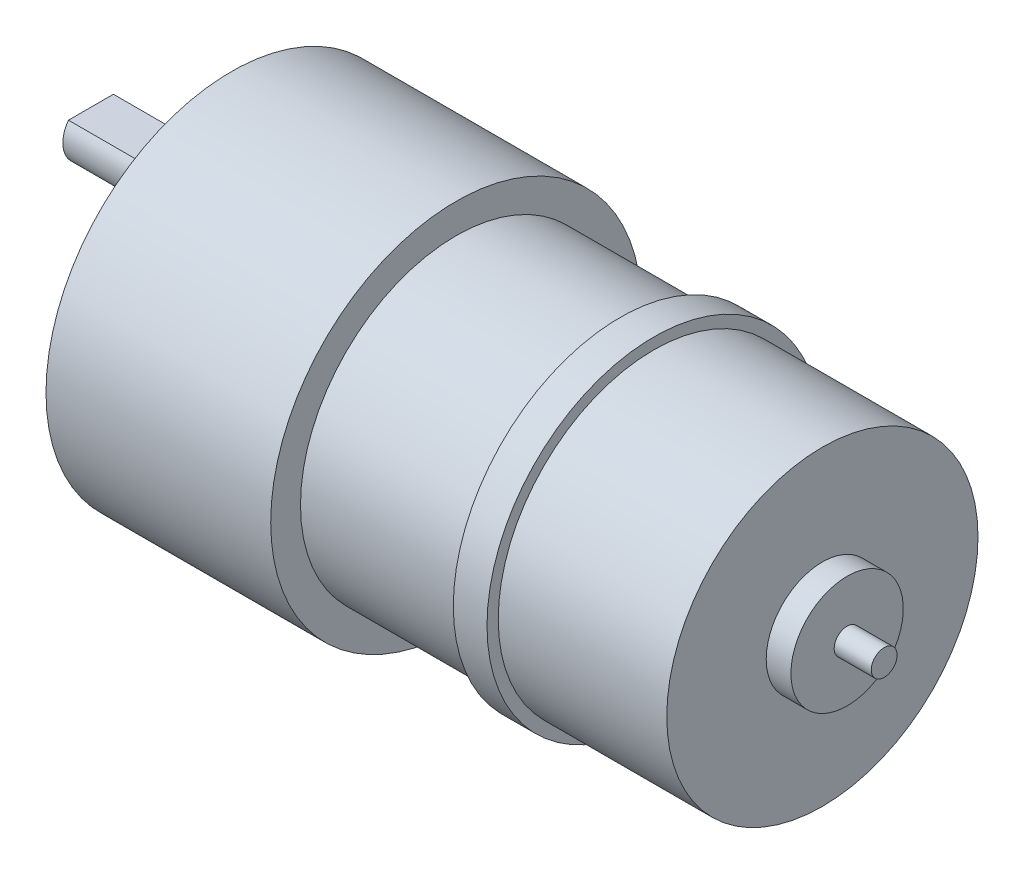
ISO-10303-21;
HEADER;
FILE_DESCRIPTION(('STEP AP214'),'2;1');
FILE_NAME('part.step','',(''),(''),'','','');
FILE_SCHEMA(('AUTOMOTIVE_DESIGN { 1 0 10303 214 1 1 1 1 }'));
ENDSEC;
DATA;
#1=APPLICATION_CONTEXT('core data for automotive mechanical design processes');
#2=APPLICATION_PROTOCOL_DEFINITION('international standard','automotive_design',2000,#1);
#3=PRODUCT_CONTEXT('',#1,'mechanical');
#4=PRODUCT('Part','Part','',(#3));
#5=PRODUCT_RELATED_PRODUCT_CATEGORY('part','',(#4));
#6=PRODUCT_DEFINITION_FORMATION('','',#4);
#7=PRODUCT_DEFINITION_CONTEXT('part definition',#1,'design');
#8=PRODUCT_DEFINITION('design','',#6,#7);
#9=PRODUCT_DEFINITION_SHAPE('','',#8);
#10=(LENGTH_UNIT() NAMED_UNIT(*) SI_UNIT(.MILLI.,.METRE.));
#11=(NAMED_UNIT(*) PLANE_ANGLE_UNIT() SI_UNIT($,.RADIAN.));
#12=(NAMED_UNIT(*) SI_UNIT($,.STERADIAN.) SOLID_ANGLE_UNIT());
#13=UNCERTAINTY_MEASURE_WITH_UNIT(LENGTH_MEASURE(1.E-05),#10,'distance_accuracy_value','');
#14=(GEOMETRIC_REPRESENTATION_CONTEXT(3) GLOBAL_UNCERTAINTY_ASSIGNED_CONTEXT((#13)) GLOBAL_UNIT_ASSIGNED_CONTEXT((#10,
#11,#12)) REPRESENTATION_CONTEXT('',''));
#15=CARTESIAN_POINT('',(0.,0.,0.));
#16=DIRECTION('',(0.,0.,1.));
#17=DIRECTION('',(1.,0.,0.));
#18=AXIS2_PLACEMENT_3D('',#15,#16,#17);
#19=CARTESIAN_POINT('',(58.1,0.,0.));
#20=DIRECTION('',(-1.,0.,0.));
#21=DIRECTION('',(0.,0.,1.));
#22=AXIS2_PLACEMENT_3D('',#19,#20,#21);
#23=PLANE('',#22);
#24=CARTESIAN_POINT('',(58.1,0.,0.));
#25=DIRECTION('',(-1.,0.,0.));
#26=DIRECTION('',(0.,0.,1.));
#27=AXIS2_PLACEMENT_3D('',#24,#25,#26);
#28=CIRCLE('',#27,1.15);
#29=CARTESIAN_POINT('',(58.1,0.,1.15));
#30=VERTEX_POINT('',#29);
#31=EDGE_CURVE('E11',#30,#30,#28,.T.);
#32=ORIENTED_EDGE('',*,*,#31,.F.);
#33=EDGE_LOOP('',(#32));
#34=FACE_BOUND('',#33,.T.);
#35=ADVANCED_FACE('F36',(#34),#23,.F.);
#36=CARTESIAN_POINT('',(0.,0.,0.));
#37=DIRECTION('',(-1.,0.,0.));
#38=DIRECTION('',(0.,0.,1.));
#39=AXIS2_PLACEMENT_3D('',#36,#37,#38);
#40=CYLINDRICAL_SURFACE('',#39,1.15);
#41=ORIENTED_EDGE('',*,*,#31,.T.);
#42=EDGE_LOOP('',(#41));
#43=FACE_BOUND('',#42,.T.);
#44=CARTESIAN_POINT('',(54.8,0.,0.));
#45=DIRECTION('',(-1.,0.,0.));
#46=DIRECTION('',(0.,0.,1.));
#47=AXIS2_PLACEMENT_3D('',#44,#45,#46);
#48=CIRCLE('',#47,1.15);
#49=CARTESIAN_POINT('',(54.8,0.,1.15));
#50=VERTEX_POINT('',#49);
#51=EDGE_CURVE('E43',#50,#50,#48,.T.);
#52=ORIENTED_EDGE('',*,*,#51,.F.);
#53=EDGE_LOOP('',(#52));
#54=FACE_BOUND('',#53,.T.);
#55=ADVANCED_FACE('F121',(#43,#54),#40,.T.);
#56=CARTESIAN_POINT('',(54.8,0.,0.));
#57=DIRECTION('',(-1.,0.,0.));
#58=DIRECTION('',(0.,0.,1.));
#59=AXIS2_PLACEMENT_3D('',#56,#57,#58);
#60=PLANE('',#59);
#61=CARTESIAN_POINT('',(54.8,0.,0.));
#62=DIRECTION('',(-1.,0.,0.));
#63=DIRECTION('',(0.,0.,1.));
#64=AXIS2_PLACEMENT_3D('',#61,#62,#63);
#65=CIRCLE('',#64,5.);
#66=CARTESIAN_POINT('',(54.8,0.,5.));
#67=VERTEX_POINT('',#66);
#68=EDGE_CURVE('E114',#67,#67,#65,.T.);
#69=ORIENTED_EDGE('',*,*,#68,.F.);
#70=EDGE_LOOP('',(#69));
#71=FACE_BOUND('',#70,.T.);
#72=ORIENTED_EDGE('',*,*,#51,.T.);
#73=EDGE_LOOP('',(#72));
#74=FACE_BOUND('',#73,.T.);
#75=ADVANCED_FACE('F119',(#71,#74),#60,.F.);
#76=CARTESIAN_POINT('',(0.,0.,0.));
#77=DIRECTION('',(-1.,0.,0.));
#78=DIRECTION('',(0.,0.,1.));
#79=AXIS2_PLACEMENT_3D('',#76,#77,#78);
#80=CYLINDRICAL_SURFACE('',#79,5.);
#81=ORIENTED_EDGE('',*,*,#68,.T.);
#82=EDGE_LOOP('',(#81));
#83=FACE_BOUND('',#82,.T.);
#84=CARTESIAN_POINT('',(52.6,0.,0.));
#85=DIRECTION('',(-1.,0.,0.));
#86=DIRECTION('',(0.,0.,1.));
#87=AXIS2_PLACEMENT_3D('',#84,#85,#86);
#88=CIRCLE('',#87,5.);
#89=CARTESIAN_POINT('',(52.6,0.,5.));
#90=VERTEX_POINT('',#89);
#91=EDGE_CURVE('E111',#90,#90,#88,.T.);
#92=ORIENTED_EDGE('',*,*,#91,.F.);
#93=EDGE_LOOP('',(#92));
#94=FACE_BOUND('',#93,.T.);
#95=ADVANCED_FACE('F128',(#83,#94),#80,.T.);
#96=CARTESIAN_POINT('',(52.6,0.,0.));
#97=DIRECTION('',(-1.,0.,0.));
#98=DIRECTION('',(0.,0.,1.));
#99=AXIS2_PLACEMENT_3D('',#96,#97,#98);
#100=PLANE('',#99);
#101=CARTESIAN_POINT('',(52.6,0.,0.));
#102=DIRECTION('',(-1.,0.,0.));
#103=DIRECTION('',(0.,0.,1.));
#104=AXIS2_PLACEMENT_3D('',#101,#102,#103);
#105=CIRCLE('',#104,13.85);
#106=CARTESIAN_POINT('',(52.6,0.,13.85));
#107=VERTEX_POINT('',#106);
#108=EDGE_CURVE('E108',#107,#107,#105,.T.);
#109=ORIENTED_EDGE('',*,*,#108,.F.);
#110=EDGE_LOOP('',(#109));
#111=FACE_BOUND('',#110,.T.);
#112=ORIENTED_EDGE('',*,*,#91,.T.);
#113=EDGE_LOOP('',(#112));
#114=FACE_BOUND('',#113,.T.);
#115=ADVANCED_FACE('F135',(#111,#114),#100,.F.);
#116=CARTESIAN_POINT('',(0.,0.,0.));
#117=DIRECTION('',(-1.,0.,0.));
#118=DIRECTION('',(0.,0.,1.));
#119=AXIS2_PLACEMENT_3D('',#116,#117,#118);
#120=CYLINDRICAL_SURFACE('',#119,13.85);
#121=ORIENTED_EDGE('',*,*,#108,.T.);
#122=EDGE_LOOP('',(#121));
#123=FACE_BOUND('',#122,.T.);
#124=CARTESIAN_POINT('',(37.6,0.,0.));
#125=DIRECTION('',(-1.,0.,0.));
#126=DIRECTION('',(0.,0.,1.));
#127=AXIS2_PLACEMENT_3D('',#124,#125,#126);
#128=CIRCLE('',#127,13.85);
#129=CARTESIAN_POINT('',(37.6,0.,13.85));
#130=VERTEX_POINT('',#129);
#131=EDGE_CURVE('E105',#130,#130,#128,.T.);
#132=ORIENTED_EDGE('',*,*,#131,.F.);
#133=EDGE_LOOP('',(#132));
#134=FACE_BOUND('',#133,.T.);
#135=ADVANCED_FACE('F139',(#123,#134),#120,.T.);
#136=CARTESIAN_POINT('',(37.6,0.,0.));
#137=DIRECTION('',(-1.,0.,0.));
#138=DIRECTION('',(0.,0.,1.));
#139=AXIS2_PLACEMENT_3D('',#136,#137,#138);
#140=PLANE('',#139);
#141=CARTESIAN_POINT('',(37.6,0.,0.));
#142=DIRECTION('',(-1.,0.,0.));
#143=DIRECTION('',(0.,0.,1.));
#144=AXIS2_PLACEMENT_3D('',#141,#142,#143);
#145=CIRCLE('',#144,14.85);
#146=CARTESIAN_POINT('',(37.6,0.,14.85));
#147=VERTEX_POINT('',#146);
#148=EDGE_CURVE('E102',#147,#147,#145,.T.);
#149=ORIENTED_EDGE('',*,*,#148,.F.);
#150=EDGE_LOOP('',(#149));
#151=FACE_BOUND('',#150,.T.);
#152=ORIENTED_EDGE('',*,*,#131,.T.);
#153=EDGE_LOOP('',(#152));
#154=FACE_BOUND('',#153,.T.);
#155=ADVANCED_FACE('F143',(#151,#154),#140,.F.);
#156=CARTESIAN_POINT('',(0.,0.,0.));
#157=DIRECTION('',(-1.,0.,0.));
#158=DIRECTION('',(0.,0.,1.));
#159=AXIS2_PLACEMENT_3D('',#156,#157,#158);
#160=CYLINDRICAL_SURFACE('',#159,14.85);
#161=ORIENTED_EDGE('',*,*,#148,.T.);
#162=EDGE_LOOP('',(#161));
#163=FACE_BOUND('',#162,.T.);
#164=CARTESIAN_POINT('',(34.6,0.,0.));
#165=DIRECTION('',(-1.,0.,0.));
#166=DIRECTION('',(0.,0.,1.));
#167=AXIS2_PLACEMENT_3D('',#164,#165,#166);
#168=CIRCLE('',#167,14.85);
#169=CARTESIAN_POINT('',(34.6,0.,14.85));
#170=VERTEX_POINT('',#169);
#171=EDGE_CURVE('E99',#170,#170,#168,.T.);
#172=ORIENTED_EDGE('',*,*,#171,.F.);
#173=EDGE_LOOP('',(#172));
#174=FACE_BOUND('',#173,.T.);
#175=ADVANCED_FACE('F147',(#163,#174),#160,.T.);
#176=CARTESIAN_POINT('',(34.6,0.,0.));
#177=DIRECTION('',(-1.,0.,0.));
#178=DIRECTION('',(0.,0.,1.));
#179=AXIS2_PLACEMENT_3D('',#176,#177,#178);
#180=PLANE('',#179);
#181=ORIENTED_EDGE('',*,*,#171,.T.);
#182=EDGE_LOOP('',(#181));
#183=FACE_BOUND('',#182,.T.);
#184=CARTESIAN_POINT('',(34.6,0.,0.));
#185=DIRECTION('',(-1.,0.,0.));
#186=DIRECTION('',(0.,0.,1.));
#187=AXIS2_PLACEMENT_3D('',#184,#185,#186);
#188=CIRCLE('',#187,13.85);
#189=CARTESIAN_POINT('',(34.6,0.,13.85));
#190=VERTEX_POINT('',#189);
#191=EDGE_CURVE('E96',#190,#190,#188,.T.);
#192=ORIENTED_EDGE('',*,*,#191,.F.);
#193=EDGE_LOOP('',(#192));
#194=FACE_BOUND('',#193,.T.);
#195=ADVANCED_FACE('F151',(#183,#194),#180,.T.);
#196=CARTESIAN_POINT('',(0.,0.,0.));
#197=DIRECTION('',(-1.,0.,0.));
#198=DIRECTION('',(0.,0.,1.));
#199=AXIS2_PLACEMENT_3D('',#196,#197,#198);
#200=CYLINDRICAL_SURFACE('',#199,13.85);
#201=ORIENTED_EDGE('',*,*,#191,.T.);
#202=EDGE_LOOP('',(#201));
#203=FACE_BOUND('',#202,.T.);
#204=CARTESIAN_POINT('',(20.,0.,0.));
#205=DIRECTION('',(-1.,0.,0.));
#206=DIRECTION('',(0.,0.,1.));
#207=AXIS2_PLACEMENT_3D('',#204,#205,#206);
#208=CIRCLE('',#207,13.85);
#209=CARTESIAN_POINT('',(20.,0.,13.85));
#210=VERTEX_POINT('',#209);
#211=EDGE_CURVE('E93',#210,#210,#208,.T.);
#212=ORIENTED_EDGE('',*,*,#211,.F.);
#213=EDGE_LOOP('',(#212));
#214=FACE_BOUND('',#213,.T.);
#215=ADVANCED_FACE('F155',(#203,#214),#200,.T.);
#216=CARTESIAN_POINT('',(20.,0.,0.));
#217=DIRECTION('',(-1.,0.,0.));
#218=DIRECTION('',(0.,0.,1.));
#219=AXIS2_PLACEMENT_3D('',#216,#217,#218);
#220=PLANE('',#219);
#221=CARTESIAN_POINT('',(20.,0.,0.));
#222=DIRECTION('',(-1.,0.,0.));
#223=DIRECTION('',(0.,0.,1.));
#224=AXIS2_PLACEMENT_3D('',#221,#222,#223);
#225=CIRCLE('',#224,16.5);
#226=CARTESIAN_POINT('',(20.,0.,16.5));
#227=VERTEX_POINT('',#226);
#228=EDGE_CURVE('E90',#227,#227,#225,.T.);
#229=ORIENTED_EDGE('',*,*,#228,.F.);
#230=EDGE_LOOP('',(#229));
#231=FACE_BOUND('',#230,.T.);
#232=ORIENTED_EDGE('',*,*,#211,.T.);
#233=EDGE_LOOP('',(#232));
#234=FACE_BOUND('',#233,.T.);
#235=ADVANCED_FACE('F159',(#231,#234),#220,.F.);
#236=CARTESIAN_POINT('',(0.,0.,0.));
#237=DIRECTION('',(-1.,0.,0.));
#238=DIRECTION('',(0.,0.,1.));
#239=AXIS2_PLACEMENT_3D('',#236,#237,#238);
#240=CYLINDRICAL_SURFACE('',#239,16.5);
#241=ORIENTED_EDGE('',*,*,#228,.T.);
#242=EDGE_LOOP('',(#241));
#243=FACE_BOUND('',#242,.T.);
#244=CARTESIAN_POINT('',(0.,0.,0.));
#245=DIRECTION('',(-1.,0.,0.));
#246=DIRECTION('',(0.,0.,1.));
#247=AXIS2_PLACEMENT_3D('',#244,#245,#246);
#248=CIRCLE('',#247,16.5);
#249=CARTESIAN_POINT('',(0.,0.,16.5));
#250=VERTEX_POINT('',#249);
#251=EDGE_CURVE('E87',#250,#250,#248,.T.);
#252=ORIENTED_EDGE('',*,*,#251,.F.);
#253=EDGE_LOOP('',(#252));
#254=FACE_BOUND('',#253,.T.);
#255=ADVANCED_FACE('F163',(#243,#254),#240,.T.);
#256=CARTESIAN_POINT('',(0.,0.,0.));
#257=DIRECTION('',(-1.,0.,0.));
#258=DIRECTION('',(0.,0.,1.));
#259=AXIS2_PLACEMENT_3D('',#256,#257,#258);
#260=PLANE('',#259);
#261=CARTESIAN_POINT('',(0.,6.,0.));
#262=DIRECTION('',(-1.,0.,0.));
#263=DIRECTION('',(0.,0.,1.));
#264=AXIS2_PLACEMENT_3D('',#261,#262,#263);
#265=CIRCLE('',#264,5.);
#266=CARTESIAN_POINT('',(0.,6.,5.));
#267=VERTEX_POINT('',#266);
#268=EDGE_CURVE('E84',#267,#267,#265,.T.);
#269=ORIENTED_EDGE('',*,*,#268,.F.);
#270=EDGE_LOOP('',(#269));
#271=FACE_BOUND('',#270,.T.);
#272=ORIENTED_EDGE('',*,*,#251,.T.);
#273=EDGE_LOOP('',(#272));
#274=FACE_BOUND('',#273,.T.);
#275=ADVANCED_FACE('F167',(#271,#274),#260,.T.);
#276=CARTESIAN_POINT('',(-12.5,6.,0.));
#277=DIRECTION('',(-1.,0.,0.));
#278=DIRECTION('',(0.,0.,1.));
#279=AXIS2_PLACEMENT_3D('',#276,#277,#278);
#280=CYLINDRICAL_SURFACE('',#279,5.);
#281=CARTESIAN_POINT('',(-2.,6.,0.));
#282=DIRECTION('',(-1.,0.,0.));
#283=DIRECTION('',(0.,0.,1.));
#284=AXIS2_PLACEMENT_3D('',#281,#282,#283);
#285=CIRCLE('',#284,5.);
#286=CARTESIAN_POINT('',(-2.,6.,5.));
#287=VERTEX_POINT('',#286);
#288=EDGE_CURVE('E78',#287,#287,#285,.T.);
#289=ORIENTED_EDGE('',*,*,#288,.F.);
#290=EDGE_LOOP('',(#289));
#291=FACE_BOUND('',#290,.T.);
#292=ORIENTED_EDGE('',*,*,#268,.T.);
#293=EDGE_LOOP('',(#292));
#294=FACE_BOUND('',#293,.T.);
#295=ADVANCED_FACE('F171',(#291,#294),#280,.T.);
#296=CARTESIAN_POINT('',(-2.,0.,0.));
#297=DIRECTION('',(-1.,0.,0.));
#298=DIRECTION('',(0.,0.,1.));
#299=AXIS2_PLACEMENT_3D('',#296,#297,#298);
#300=PLANE('',#299);
#301=ORIENTED_EDGE('',*,*,#288,.T.);
#302=EDGE_LOOP('',(#301));
#303=FACE_BOUND('',#302,.T.);
#304=CARTESIAN_POINT('',(-2.,6.,0.));
#305=DIRECTION('',(-1.,0.,0.));
#306=DIRECTION('',(0.,0.,1.));
#307=AXIS2_PLACEMENT_3D('',#304,#305,#306);
#308=CIRCLE('',#307,2.5);
#309=CARTESIAN_POINT('',(-2.,6.,2.5));
#310=VERTEX_POINT('',#309);
#311=EDGE_CURVE('E75',#310,#310,#308,.T.);
#312=ORIENTED_EDGE('',*,*,#311,.F.);
#313=EDGE_LOOP('',(#312));
#314=FACE_BOUND('',#313,.T.);
#315=ADVANCED_FACE('F175',(#303,#314),#300,.T.);
#316=CARTESIAN_POINT('',(-12.5,6.,0.));
#317=DIRECTION('',(-1.,0.,0.));
#318=DIRECTION('',(0.,0.,1.));
#319=AXIS2_PLACEMENT_3D('',#316,#317,#318);
#320=CYLINDRICAL_SURFACE('',#319,2.5);
#321=DIRECTION('',(-1.,0.,0.));
#322=VECTOR('',#321,1.);
#323=CARTESIAN_POINT('',(-4.5,7.5,2.));
#324=LINE('',#323,#322);
#325=CARTESIAN_POINT('',(-4.5,7.5,2.));
#326=VERTEX_POINT('',#325);
#327=CARTESIAN_POINT('',(-12.5,7.5,2.));
#328=VERTEX_POINT('',#327);
#329=EDGE_CURVE('E56',#326,#328,#324,.T.);
#330=ORIENTED_EDGE('',*,*,#329,.T.);
#331=CARTESIAN_POINT('',(-12.5,6.,0.));
#332=DIRECTION('',(-1.,0.,0.));
#333=DIRECTION('',(0.,0.,1.));
#334=AXIS2_PLACEMENT_3D('',#331,#332,#333);
#335=CIRCLE('',#334,2.5);
#336=CARTESIAN_POINT('',(-12.5,7.5,-2.));
#337=VERTEX_POINT('',#336);
#338=EDGE_CURVE('E72',#337,#328,#335,.T.);
#339=ORIENTED_EDGE('',*,*,#338,.F.);
#340=DIRECTION('',(-1.,0.,0.));
#341=VECTOR('',#340,1.);
#342=CARTESIAN_POINT('',(-4.5,7.5,-2.));
#343=LINE('',#342,#341);
#344=CARTESIAN_POINT('',(-4.5,7.5,-2.));
#345=VERTEX_POINT('',#344);
#346=EDGE_CURVE('E50',#345,#337,#343,.T.);
#347=ORIENTED_EDGE('',*,*,#346,.F.);
#348=CARTESIAN_POINT('',(-4.5,6.,0.));
#349=DIRECTION('',(-1.,0.,0.));
#350=DIRECTION('',(0.,0.,1.));
#351=AXIS2_PLACEMENT_3D('',#348,#349,#350);
#352=CIRCLE('',#351,2.5);
#353=EDGE_CURVE('E66',#326,#345,#352,.T.);
#354=ORIENTED_EDGE('',*,*,#353,.F.);
#355=EDGE_LOOP('',(#330,#339,#347,#354));
#356=FACE_BOUND('',#355,.T.);
#357=ORIENTED_EDGE('',*,*,#311,.T.);
#358=EDGE_LOOP('',(#357));
#359=FACE_BOUND('',#358,.T.);
#360=ADVANCED_FACE('F70',(#356,#359),#320,.T.);
#361=CARTESIAN_POINT('',(-12.5,0.,0.));
#362=DIRECTION('',(-1.,0.,0.));
#363=DIRECTION('',(0.,0.,1.));
#364=AXIS2_PLACEMENT_3D('',#361,#362,#363);
#365=PLANE('',#364);
#366=DIRECTION('',(0.,0.,1.));
#367=VECTOR('',#366,1.);
#368=CARTESIAN_POINT('',(-12.5,7.5,0.));
#369=LINE('',#368,#367);
#370=EDGE_CURVE('E61',#337,#328,#369,.T.);
#371=ORIENTED_EDGE('',*,*,#370,.F.);
#372=ORIENTED_EDGE('',*,*,#338,.T.);
#373=EDGE_LOOP('',(#371,#372));
#374=FACE_BOUND('',#373,.T.);
#375=ADVANCED_FACE('F74',(#374),#365,.T.);
#376=CARTESIAN_POINT('',(-4.5,7.5,0.));
#377=DIRECTION('',(0.,-1.,0.));
#378=DIRECTION('',(0.,0.,-1.));
#379=AXIS2_PLACEMENT_3D('',#376,#377,#378);
#380=PLANE('',#379);
#381=ORIENTED_EDGE('',*,*,#370,.T.);
#382=ORIENTED_EDGE('',*,*,#329,.F.);
#383=DIRECTION('',(0.,0.,1.));
#384=VECTOR('',#383,1.);
#385=CARTESIAN_POINT('',(-4.5,7.5,0.));
#386=LINE('',#385,#384);
#387=EDGE_CURVE('E191',#345,#326,#386,.T.);
#388=ORIENTED_EDGE('',*,*,#387,.F.);
#389=ORIENTED_EDGE('',*,*,#346,.T.);
#390=EDGE_LOOP('',(#381,#382,#388,#389));
#391=FACE_BOUND('',#390,.T.);
#392=ADVANCED_FACE('F62',(#391),#380,.F.);
#393=CARTESIAN_POINT('',(-4.5,0.,0.));
#394=DIRECTION('',(-1.,0.,0.));
#395=DIRECTION('',(0.,0.,1.));
#396=AXIS2_PLACEMENT_3D('',#393,#394,#395);
#397=PLANE('',#396);
#398=ORIENTED_EDGE('',*,*,#353,.T.);
#399=ORIENTED_EDGE('',*,*,#387,.T.);
#400=EDGE_LOOP('',(#398,#399));
#401=FACE_BOUND('',#400,.T.);
#402=ADVANCED_FACE('F186',(#401),#397,.T.);
#403=CLOSED_SHELL('',(#35,#55,#75,#95,#115,#135,#155,#175,#195,#215,#235,#255,#275,#295,#315,
#360,#375,#392,#402));
#404=MANIFOLD_SOLID_BREP('B2',#403);
#405=ADVANCED_BREP_SHAPE_REPRESENTATION('',(#18,#404),#14);
#406=SHAPE_DEFINITION_REPRESENTATION(#9,#405);
ENDSEC;
END-ISO-10303-21;
